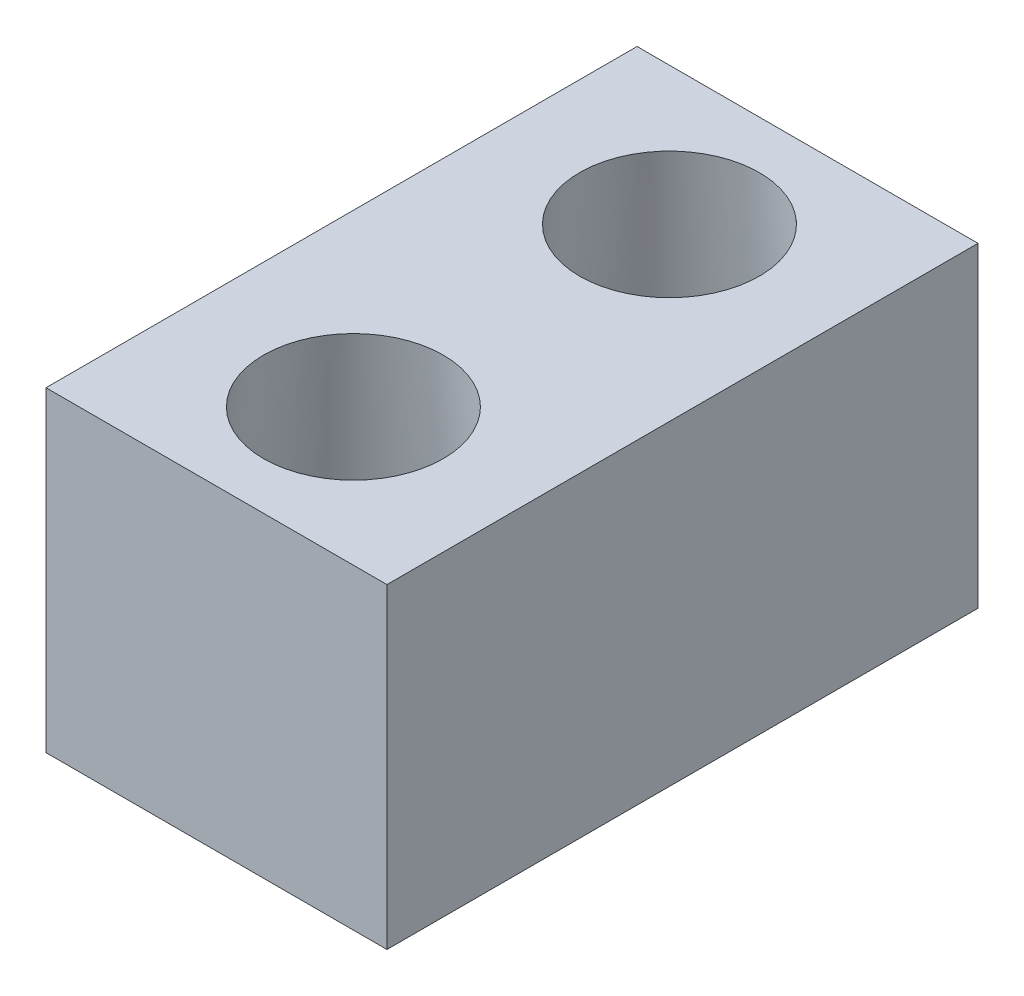
ISO-10303-21;
HEADER;
FILE_DESCRIPTION(('STEP AP214'),'2;1');
FILE_NAME('part.step','',(''),(''),'','','');
FILE_SCHEMA(('AUTOMOTIVE_DESIGN { 1 0 10303 214 1 1 1 1 }'));
ENDSEC;
DATA;
#1=APPLICATION_CONTEXT('core data for automotive mechanical design processes');
#2=APPLICATION_PROTOCOL_DEFINITION('international standard','automotive_design',2000,#1);
#3=PRODUCT_CONTEXT('',#1,'mechanical');
#4=PRODUCT('Part','Part','',(#3));
#5=PRODUCT_RELATED_PRODUCT_CATEGORY('part','',(#4));
#6=PRODUCT_DEFINITION_FORMATION('','',#4);
#7=PRODUCT_DEFINITION_CONTEXT('part definition',#1,'design');
#8=PRODUCT_DEFINITION('design','',#6,#7);
#9=PRODUCT_DEFINITION_SHAPE('','',#8);
#10=(LENGTH_UNIT() NAMED_UNIT(*) SI_UNIT(.MILLI.,.METRE.));
#11=(NAMED_UNIT(*) PLANE_ANGLE_UNIT() SI_UNIT($,.RADIAN.));
#12=(NAMED_UNIT(*) SI_UNIT($,.STERADIAN.) SOLID_ANGLE_UNIT());
#13=UNCERTAINTY_MEASURE_WITH_UNIT(LENGTH_MEASURE(1.E-05),#10,'distance_accuracy_value','');
#14=(GEOMETRIC_REPRESENTATION_CONTEXT(3) GLOBAL_UNCERTAINTY_ASSIGNED_CONTEXT((#13)) GLOBAL_UNIT_ASSIGNED_CONTEXT((#10,
#11,#12)) REPRESENTATION_CONTEXT('',''));
#15=CARTESIAN_POINT('',(0.,0.,0.));
#16=DIRECTION('',(0.,0.,1.));
#17=DIRECTION('',(1.,0.,0.));
#18=AXIS2_PLACEMENT_3D('',#15,#16,#17);
#19=CARTESIAN_POINT('',(27.4,50.8,48.2954545454546));
#20=DIRECTION('',(0.,0.,1.));
#21=DIRECTION('',(1.,0.,0.));
#22=AXIS2_PLACEMENT_3D('',#19,#20,#21);
#23=PLANE('',#22);
#24=DIRECTION('',(-1.,0.,0.));
#25=VECTOR('',#24,1.);
#26=CARTESIAN_POINT('',(27.4,0.,48.2954545454546));
#27=LINE('',#26,#25);
#28=CARTESIAN_POINT('',(27.4,0.,48.2954545454546));
#29=VERTEX_POINT('',#28);
#30=CARTESIAN_POINT('',(-27.4,0.,48.2954545454546));
#31=VERTEX_POINT('',#30);
#32=EDGE_CURVE('E122',#29,#31,#27,.T.);
#33=ORIENTED_EDGE('',*,*,#32,.F.);
#34=DIRECTION('',(0.,-1.,0.));
#35=VECTOR('',#34,1.);
#36=CARTESIAN_POINT('',(27.4,50.8,48.2954545454546));
#37=LINE('',#36,#35);
#38=CARTESIAN_POINT('',(27.4,50.8,48.2954545454546));
#39=VERTEX_POINT('',#38);
#40=EDGE_CURVE('E12',#39,#29,#37,.T.);
#41=ORIENTED_EDGE('',*,*,#40,.F.);
#42=DIRECTION('',(-1.,0.,0.));
#43=VECTOR('',#42,1.);
#44=CARTESIAN_POINT('',(27.4,50.8,48.2954545454546));
#45=LINE('',#44,#43);
#46=CARTESIAN_POINT('',(-27.4,50.8,48.2954545454546));
#47=VERTEX_POINT('',#46);
#48=EDGE_CURVE('E114',#39,#47,#45,.T.);
#49=ORIENTED_EDGE('',*,*,#48,.T.);
#50=DIRECTION('',(0.,-1.,0.));
#51=VECTOR('',#50,1.);
#52=CARTESIAN_POINT('',(-27.4,50.8,48.2954545454546));
#53=LINE('',#52,#51);
#54=EDGE_CURVE('E90',#47,#31,#53,.T.);
#55=ORIENTED_EDGE('',*,*,#54,.T.);
#56=EDGE_LOOP('',(#33,#41,#49,#55));
#57=FACE_BOUND('',#56,.T.);
#58=ADVANCED_FACE('F47',(#57),#23,.T.);
#59=CARTESIAN_POINT('',(27.4,50.8,48.2954545454546));
#60=DIRECTION('',(-1.,0.,0.));
#61=DIRECTION('',(0.,0.,1.));
#62=AXIS2_PLACEMENT_3D('',#59,#60,#61);
#63=PLANE('',#62);
#64=DIRECTION('',(0.,0.,-1.));
#65=VECTOR('',#64,1.);
#66=CARTESIAN_POINT('',(27.4,0.,48.2954545454546));
#67=LINE('',#66,#65);
#68=CARTESIAN_POINT('',(27.4,0.,-46.7045454545455));
#69=VERTEX_POINT('',#68);
#70=EDGE_CURVE('E82',#29,#69,#67,.T.);
#71=ORIENTED_EDGE('',*,*,#70,.T.);
#72=DIRECTION('',(0.,-1.,0.));
#73=VECTOR('',#72,1.);
#74=CARTESIAN_POINT('',(27.4,50.8,-46.7045454545455));
#75=LINE('',#74,#73);
#76=CARTESIAN_POINT('',(27.4,50.8,-46.7045454545455));
#77=VERTEX_POINT('',#76);
#78=EDGE_CURVE('E58',#77,#69,#75,.T.);
#79=ORIENTED_EDGE('',*,*,#78,.F.);
#80=DIRECTION('',(0.,0.,-1.));
#81=VECTOR('',#80,1.);
#82=CARTESIAN_POINT('',(27.4,50.8,48.2954545454546));
#83=LINE('',#82,#81);
#84=EDGE_CURVE('E100',#39,#77,#83,.T.);
#85=ORIENTED_EDGE('',*,*,#84,.F.);
#86=ORIENTED_EDGE('',*,*,#40,.T.);
#87=EDGE_LOOP('',(#71,#79,#85,#86));
#88=FACE_BOUND('',#87,.T.);
#89=ADVANCED_FACE('F169',(#88),#63,.F.);
#90=CARTESIAN_POINT('',(27.4,50.8,-46.7045454545455));
#91=DIRECTION('',(0.,0.,1.));
#92=DIRECTION('',(1.,0.,0.));
#93=AXIS2_PLACEMENT_3D('',#90,#91,#92);
#94=PLANE('',#93);
#95=DIRECTION('',(-1.,0.,0.));
#96=VECTOR('',#95,1.);
#97=CARTESIAN_POINT('',(27.4,0.,-46.7045454545455));
#98=LINE('',#97,#96);
#99=CARTESIAN_POINT('',(-27.4,0.,-46.7045454545454));
#100=VERTEX_POINT('',#99);
#101=EDGE_CURVE('E108',#69,#100,#98,.T.);
#102=ORIENTED_EDGE('',*,*,#101,.T.);
#103=DIRECTION('',(0.,-1.,0.));
#104=VECTOR('',#103,1.);
#105=CARTESIAN_POINT('',(-27.4,50.8,-46.7045454545454));
#106=LINE('',#105,#104);
#107=CARTESIAN_POINT('',(-27.4,50.8,-46.7045454545454));
#108=VERTEX_POINT('',#107);
#109=EDGE_CURVE('E105',#108,#100,#106,.T.);
#110=ORIENTED_EDGE('',*,*,#109,.F.);
#111=DIRECTION('',(-1.,0.,0.));
#112=VECTOR('',#111,1.);
#113=CARTESIAN_POINT('',(27.4,50.8,-46.7045454545455));
#114=LINE('',#113,#112);
#115=EDGE_CURVE('E95',#77,#108,#114,.T.);
#116=ORIENTED_EDGE('',*,*,#115,.F.);
#117=ORIENTED_EDGE('',*,*,#78,.T.);
#118=EDGE_LOOP('',(#102,#110,#116,#117));
#119=FACE_BOUND('',#118,.T.);
#120=ADVANCED_FACE('F106',(#119),#94,.F.);
#121=CARTESIAN_POINT('',(-27.4,50.8,48.2954545454546));
#122=DIRECTION('',(-1.,0.,0.));
#123=DIRECTION('',(0.,0.,1.));
#124=AXIS2_PLACEMENT_3D('',#121,#122,#123);
#125=PLANE('',#124);
#126=DIRECTION('',(0.,0.,-1.));
#127=VECTOR('',#126,1.);
#128=CARTESIAN_POINT('',(-27.4,0.,48.2954545454546));
#129=LINE('',#128,#127);
#130=EDGE_CURVE('E126',#31,#100,#129,.T.);
#131=ORIENTED_EDGE('',*,*,#130,.F.);
#132=ORIENTED_EDGE('',*,*,#54,.F.);
#133=DIRECTION('',(0.,0.,-1.));
#134=VECTOR('',#133,1.);
#135=CARTESIAN_POINT('',(-27.4,50.8,48.2954545454546));
#136=LINE('',#135,#134);
#137=EDGE_CURVE('E99',#47,#108,#136,.T.);
#138=ORIENTED_EDGE('',*,*,#137,.T.);
#139=ORIENTED_EDGE('',*,*,#109,.T.);
#140=EDGE_LOOP('',(#131,#132,#138,#139));
#141=FACE_BOUND('',#140,.T.);
#142=ADVANCED_FACE('F112',(#141),#125,.T.);
#143=CARTESIAN_POINT('',(0.,50.8,0.));
#144=DIRECTION('',(0.,-1.,0.));
#145=DIRECTION('',(0.,0.,-1.));
#146=AXIS2_PLACEMENT_3D('',#143,#144,#145);
#147=PLANE('',#146);
#148=CARTESIAN_POINT('',(-0.0294769999999965,50.8,26.2548955454546));
#149=DIRECTION('',(0.,1.,0.));
#150=DIRECTION('',(0.,0.,1.));
#151=AXIS2_PLACEMENT_3D('',#148,#149,#150);
#152=CIRCLE('',#151,14.435817204);
#153=CARTESIAN_POINT('',(-0.0294769999999965,50.8,40.6907127494545));
#154=VERTEX_POINT('',#153);
#155=EDGE_CURVE('E275',#154,#154,#152,.T.);
#156=ORIENTED_EDGE('',*,*,#155,.F.);
#157=EDGE_LOOP('',(#156));
#158=FACE_BOUND('',#157,.T.);
#159=CARTESIAN_POINT('',(-0.0294769999999965,50.8,-24.5451044545454));
#160=DIRECTION('',(0.,1.,0.));
#161=DIRECTION('',(0.,0.,1.));
#162=AXIS2_PLACEMENT_3D('',#159,#160,#161);
#163=CIRCLE('',#162,14.435817204);
#164=CARTESIAN_POINT('',(-0.0294769999999965,50.8,-10.1092872505454));
#165=VERTEX_POINT('',#164);
#166=EDGE_CURVE('E289',#165,#165,#163,.T.);
#167=ORIENTED_EDGE('',*,*,#166,.F.);
#168=EDGE_LOOP('',(#167));
#169=FACE_BOUND('',#168,.T.);
#170=ORIENTED_EDGE('',*,*,#48,.F.);
#171=ORIENTED_EDGE('',*,*,#84,.T.);
#172=ORIENTED_EDGE('',*,*,#115,.T.);
#173=ORIENTED_EDGE('',*,*,#137,.F.);
#174=EDGE_LOOP('',(#170,#171,#172,#173));
#175=FACE_BOUND('',#174,.T.);
#176=ADVANCED_FACE('F98',(#158,#169,#175),#147,.F.);
#177=CARTESIAN_POINT('',(0.,0.,0.));
#178=DIRECTION('',(0.,-1.,0.));
#179=DIRECTION('',(0.,0.,-1.));
#180=AXIS2_PLACEMENT_3D('',#177,#178,#179);
#181=PLANE('',#180);
#182=CARTESIAN_POINT('',(-0.0294769999999965,0.,26.2548955454546));
#183=DIRECTION('',(0.,-1.,0.));
#184=DIRECTION('',(0.,0.,-1.));
#185=AXIS2_PLACEMENT_3D('',#182,#183,#184);
#186=CIRCLE('',#185,19.05);
#187=CARTESIAN_POINT('',(-0.0294769999999965,0.,7.20489554545455));
#188=VERTEX_POINT('',#187);
#189=EDGE_CURVE('E127',#188,#188,#186,.T.);
#190=ORIENTED_EDGE('',*,*,#189,.F.);
#191=EDGE_LOOP('',(#190));
#192=FACE_BOUND('',#191,.T.);
#193=CARTESIAN_POINT('',(-0.0294769999999965,0.,-24.5451044545454));
#194=DIRECTION('',(0.,-1.,0.));
#195=DIRECTION('',(0.,0.,1.));
#196=AXIS2_PLACEMENT_3D('',#193,#194,#195);
#197=CIRCLE('',#196,19.05);
#198=CARTESIAN_POINT('',(-0.0294769999999965,0.,-5.49510445454545));
#199=VERTEX_POINT('',#198);
#200=EDGE_CURVE('E301',#199,#199,#197,.T.);
#201=ORIENTED_EDGE('',*,*,#200,.F.);
#202=EDGE_LOOP('',(#201));
#203=FACE_BOUND('',#202,.T.);
#204=ORIENTED_EDGE('',*,*,#32,.T.);
#205=ORIENTED_EDGE('',*,*,#130,.T.);
#206=ORIENTED_EDGE('',*,*,#101,.F.);
#207=ORIENTED_EDGE('',*,*,#70,.F.);
#208=EDGE_LOOP('',(#204,#205,#206,#207));
#209=FACE_BOUND('',#208,.T.);
#210=ADVANCED_FACE('F160',(#192,#203,#209),#181,.T.);
#211=CARTESIAN_POINT('',(-0.0294769999999965,5.,-24.5451044545454));
#212=DIRECTION('',(0.,-1.,0.));
#213=DIRECTION('',(0.,0.,-1.));
#214=AXIS2_PLACEMENT_3D('',#211,#212,#213);
#215=CYLINDRICAL_SURFACE('',#214,19.05);
#216=CARTESIAN_POINT('',(-0.0294769999999965,5.,-24.5451044545454));
#217=DIRECTION('',(0.,-1.,0.));
#218=DIRECTION('',(0.,0.,1.));
#219=AXIS2_PLACEMENT_3D('',#216,#217,#218);
#220=CIRCLE('',#219,19.05);
#221=CARTESIAN_POINT('',(-0.0294769999999965,5.,-5.49510445454545));
#222=VERTEX_POINT('',#221);
#223=EDGE_CURVE('E142',#222,#222,#220,.T.);
#224=ORIENTED_EDGE('',*,*,#223,.F.);
#225=EDGE_LOOP('',(#224));
#226=FACE_BOUND('',#225,.T.);
#227=ORIENTED_EDGE('',*,*,#200,.T.);
#228=EDGE_LOOP('',(#227));
#229=FACE_BOUND('',#228,.T.);
#230=ADVANCED_FACE('F149',(#226,#229),#215,.F.);
#231=CARTESIAN_POINT('',(-0.0294769999999965,5.,26.2548955454546));
#232=DIRECTION('',(0.,-1.,0.));
#233=DIRECTION('',(0.,0.,-1.));
#234=AXIS2_PLACEMENT_3D('',#231,#232,#233);
#235=CYLINDRICAL_SURFACE('',#234,19.05);
#236=CARTESIAN_POINT('',(-0.0294769999999965,5.,26.2548955454546));
#237=DIRECTION('',(0.,-1.,0.));
#238=DIRECTION('',(0.,0.,-1.));
#239=AXIS2_PLACEMENT_3D('',#236,#237,#238);
#240=CIRCLE('',#239,19.05);
#241=CARTESIAN_POINT('',(-0.0294769999999965,5.,7.20489554545455));
#242=VERTEX_POINT('',#241);
#243=EDGE_CURVE('E50',#242,#242,#240,.T.);
#244=ORIENTED_EDGE('',*,*,#243,.F.);
#245=EDGE_LOOP('',(#244));
#246=FACE_BOUND('',#245,.T.);
#247=ORIENTED_EDGE('',*,*,#189,.T.);
#248=EDGE_LOOP('',(#247));
#249=FACE_BOUND('',#248,.T.);
#250=ADVANCED_FACE('F159',(#246,#249),#235,.F.);
#251=CARTESIAN_POINT('',(-0.0294769999999965,50.8,-24.5451044545454));
#252=DIRECTION('',(0.,-1.,0.));
#253=DIRECTION('',(0.,0.,-1.));
#254=AXIS2_PLACEMENT_3D('',#251,#252,#253);
#255=CONICAL_SURFACE('',#254,14.435817204,0.100407557415615);
#256=ORIENTED_EDGE('',*,*,#166,.T.);
#257=EDGE_LOOP('',(#256));
#258=FACE_BOUND('',#257,.T.);
#259=ORIENTED_EDGE('',*,*,#223,.T.);
#260=EDGE_LOOP('',(#259));
#261=FACE_BOUND('',#260,.T.);
#262=ADVANCED_FACE('F216',(#258,#261),#255,.F.);
#263=CARTESIAN_POINT('',(-0.0294769999999965,50.8,26.2548955454546));
#264=DIRECTION('',(0.,-1.,0.));
#265=DIRECTION('',(0.,0.,-1.));
#266=AXIS2_PLACEMENT_3D('',#263,#264,#265);
#267=CONICAL_SURFACE('',#266,14.435817204,0.100407557415615);
#268=ORIENTED_EDGE('',*,*,#155,.T.);
#269=EDGE_LOOP('',(#268));
#270=FACE_BOUND('',#269,.T.);
#271=ORIENTED_EDGE('',*,*,#243,.T.);
#272=EDGE_LOOP('',(#271));
#273=FACE_BOUND('',#272,.T.);
#274=ADVANCED_FACE('F221',(#270,#273),#267,.F.);
#275=CLOSED_SHELL('',(#58,#89,#120,#142,#176,#210,#230,#250,#262,#274));
#276=MANIFOLD_SOLID_BREP('B2',#275);
#277=ADVANCED_BREP_SHAPE_REPRESENTATION('',(#18,#276),#14);
#278=SHAPE_DEFINITION_REPRESENTATION(#9,#277);
ENDSEC;
END-ISO-10303-21;
